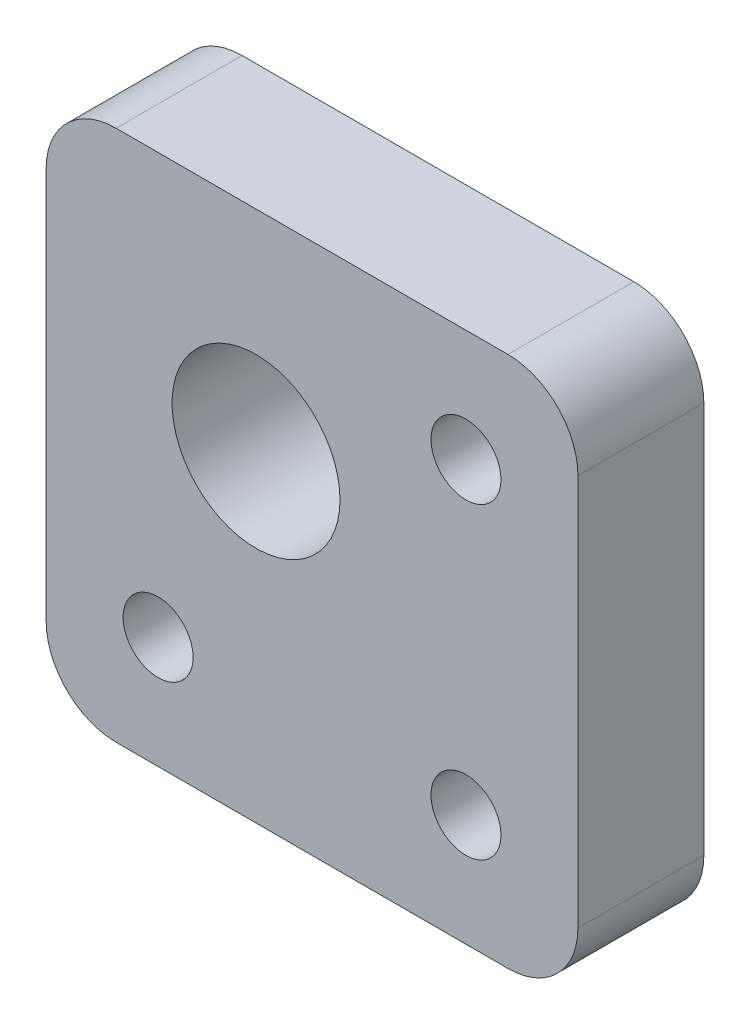
ISO-10303-21;
HEADER;
FILE_DESCRIPTION(('STEP AP214'),'2;1');
FILE_NAME('part.step','',(''),(''),'','','');
FILE_SCHEMA(('AUTOMOTIVE_DESIGN { 1 0 10303 214 1 1 1 1 }'));
ENDSEC;
DATA;
#1=APPLICATION_CONTEXT('core data for automotive mechanical design processes');
#2=APPLICATION_PROTOCOL_DEFINITION('international standard','automotive_design',2000,#1);
#3=PRODUCT_CONTEXT('',#1,'mechanical');
#4=PRODUCT('Part','Part','',(#3));
#5=PRODUCT_RELATED_PRODUCT_CATEGORY('part','',(#4));
#6=PRODUCT_DEFINITION_FORMATION('','',#4);
#7=PRODUCT_DEFINITION_CONTEXT('part definition',#1,'design');
#8=PRODUCT_DEFINITION('design','',#6,#7);
#9=PRODUCT_DEFINITION_SHAPE('','',#8);
#10=(LENGTH_UNIT() NAMED_UNIT(*) SI_UNIT(.MILLI.,.METRE.));
#11=(NAMED_UNIT(*) PLANE_ANGLE_UNIT() SI_UNIT($,.RADIAN.));
#12=(NAMED_UNIT(*) SI_UNIT($,.STERADIAN.) SOLID_ANGLE_UNIT());
#13=UNCERTAINTY_MEASURE_WITH_UNIT(LENGTH_MEASURE(1.E-05),#10,'distance_accuracy_value','');
#14=(GEOMETRIC_REPRESENTATION_CONTEXT(3) GLOBAL_UNCERTAINTY_ASSIGNED_CONTEXT((#13)) GLOBAL_UNIT_ASSIGNED_CONTEXT((#10,
#11,#12)) REPRESENTATION_CONTEXT('',''));
#15=CARTESIAN_POINT('',(0.,0.,0.));
#16=DIRECTION('',(0.,0.,1.));
#17=DIRECTION('',(1.,0.,0.));
#18=AXIS2_PLACEMENT_3D('',#15,#16,#17);
#19=CARTESIAN_POINT('',(0.,0.,9.));
#20=DIRECTION('',(0.,0.,1.));
#21=DIRECTION('',(1.,0.,0.));
#22=AXIS2_PLACEMENT_3D('',#19,#20,#21);
#23=PLANE('',#22);
#24=CARTESIAN_POINT('',(-13.1697995889595,-10.1602209944751,9.));
#25=DIRECTION('',(0.,0.,1.));
#26=DIRECTION('',(1.,0.,0.));
#27=AXIS2_PLACEMENT_3D('',#24,#25,#26);
#28=CIRCLE('',#27,2.5);
#29=CARTESIAN_POINT('',(-10.6697995889595,-10.1602209944751,9.));
#30=VERTEX_POINT('',#29);
#31=EDGE_CURVE('E187',#30,#30,#28,.T.);
#32=ORIENTED_EDGE('',*,*,#31,.F.);
#33=EDGE_LOOP('',(#32));
#34=FACE_BOUND('',#33,.T.);
#35=CARTESIAN_POINT('',(8.83020041104048,11.8397790055249,9.));
#36=DIRECTION('',(0.,0.,1.));
#37=DIRECTION('',(1.,0.,0.));
#38=AXIS2_PLACEMENT_3D('',#35,#36,#37);
#39=CIRCLE('',#38,2.5);
#40=CARTESIAN_POINT('',(11.3302004110405,11.8397790055249,9.));
#41=VERTEX_POINT('',#40);
#42=EDGE_CURVE('E128',#41,#41,#39,.T.);
#43=ORIENTED_EDGE('',*,*,#42,.F.);
#44=EDGE_LOOP('',(#43));
#45=FACE_BOUND('',#44,.T.);
#46=DIRECTION('',(-1.,0.,0.));
#47=VECTOR('',#46,1.);
#48=CARTESIAN_POINT('',(-21.1697995889595,19.8397790055249,9.));
#49=LINE('',#48,#47);
#50=CARTESIAN_POINT('',(11.8302004110405,19.8397790055249,9.));
#51=VERTEX_POINT('',#50);
#52=CARTESIAN_POINT('',(-16.1697995889595,19.8397790055249,9.));
#53=VERTEX_POINT('',#52);
#54=EDGE_CURVE('E137',#51,#53,#49,.T.);
#55=ORIENTED_EDGE('',*,*,#54,.T.);
#56=CARTESIAN_POINT('',(-16.1697995889595,14.8397790055249,9.));
#57=DIRECTION('',(0.,0.,1.));
#58=DIRECTION('',(1.,0.,0.));
#59=AXIS2_PLACEMENT_3D('',#56,#57,#58);
#60=CIRCLE('',#59,5.);
#61=CARTESIAN_POINT('',(-21.1697995889595,14.8397790055249,9.));
#62=VERTEX_POINT('',#61);
#63=EDGE_CURVE('E156',#53,#62,#60,.T.);
#64=ORIENTED_EDGE('',*,*,#63,.T.);
#65=DIRECTION('',(0.,-1.,0.));
#66=VECTOR('',#65,1.);
#67=CARTESIAN_POINT('',(-21.1697995889595,19.8397790055249,9.));
#68=LINE('',#67,#66);
#69=CARTESIAN_POINT('',(-21.1697995889595,-13.1602209944751,9.));
#70=VERTEX_POINT('',#69);
#71=EDGE_CURVE('E120',#62,#70,#68,.T.);
#72=ORIENTED_EDGE('',*,*,#71,.T.);
#73=CARTESIAN_POINT('',(-16.1697995889595,-13.1602209944751,9.));
#74=DIRECTION('',(0.,0.,1.));
#75=DIRECTION('',(1.,0.,0.));
#76=AXIS2_PLACEMENT_3D('',#73,#74,#75);
#77=CIRCLE('',#76,5.);
#78=CARTESIAN_POINT('',(-16.1697995889595,-18.1602209944751,9.));
#79=VERTEX_POINT('',#78);
#80=EDGE_CURVE('E154',#70,#79,#77,.T.);
#81=ORIENTED_EDGE('',*,*,#80,.T.);
#82=DIRECTION('',(1.,0.,0.));
#83=VECTOR('',#82,1.);
#84=CARTESIAN_POINT('',(-21.1697995889595,-18.1602209944751,9.));
#85=LINE('',#84,#83);
#86=CARTESIAN_POINT('',(11.8302004110405,-18.1602209944751,9.));
#87=VERTEX_POINT('',#86);
#88=EDGE_CURVE('E167',#79,#87,#85,.T.);
#89=ORIENTED_EDGE('',*,*,#88,.T.);
#90=CARTESIAN_POINT('',(11.8302004110405,-13.1602209944751,9.));
#91=DIRECTION('',(0.,0.,1.));
#92=DIRECTION('',(1.,0.,0.));
#93=AXIS2_PLACEMENT_3D('',#90,#91,#92);
#94=CIRCLE('',#93,5.);
#95=CARTESIAN_POINT('',(16.8302004110405,-13.1602209944751,9.));
#96=VERTEX_POINT('',#95);
#97=EDGE_CURVE('E55',#87,#96,#94,.T.);
#98=ORIENTED_EDGE('',*,*,#97,.T.);
#99=DIRECTION('',(0.,1.,0.));
#100=VECTOR('',#99,1.);
#101=CARTESIAN_POINT('',(16.8302004110405,19.8397790055249,9.));
#102=LINE('',#101,#100);
#103=CARTESIAN_POINT('',(16.8302004110405,14.8397790055249,9.));
#104=VERTEX_POINT('',#103);
#105=EDGE_CURVE('E175',#96,#104,#102,.T.);
#106=ORIENTED_EDGE('',*,*,#105,.T.);
#107=CARTESIAN_POINT('',(11.8302004110405,14.8397790055249,9.));
#108=DIRECTION('',(0.,0.,1.));
#109=DIRECTION('',(1.,0.,0.));
#110=AXIS2_PLACEMENT_3D('',#107,#108,#109);
#111=CIRCLE('',#110,5.);
#112=EDGE_CURVE('E151',#104,#51,#111,.T.);
#113=ORIENTED_EDGE('',*,*,#112,.T.);
#114=EDGE_LOOP('',(#55,#64,#72,#81,#89,#98,#106,#113));
#115=FACE_BOUND('',#114,.T.);
#116=CARTESIAN_POINT('',(8.83020041104049,-10.1602209944751,9.));
#117=DIRECTION('',(0.,0.,1.));
#118=DIRECTION('',(1.,0.,0.));
#119=AXIS2_PLACEMENT_3D('',#116,#117,#118);
#120=CIRCLE('',#119,2.5);
#121=CARTESIAN_POINT('',(11.3302004110405,-10.1602209944751,9.));
#122=VERTEX_POINT('',#121);
#123=EDGE_CURVE('E182',#122,#122,#120,.T.);
#124=ORIENTED_EDGE('',*,*,#123,.F.);
#125=EDGE_LOOP('',(#124));
#126=FACE_BOUND('',#125,.T.);
#127=CARTESIAN_POINT('',(-6.16979958895952,4.83977900552487,9.));
#128=DIRECTION('',(0.,0.,1.));
#129=DIRECTION('',(1.,0.,0.));
#130=AXIS2_PLACEMENT_3D('',#127,#128,#129);
#131=CIRCLE('',#130,6.);
#132=CARTESIAN_POINT('',(-0.169799588959522,4.83977900552487,9.));
#133=VERTEX_POINT('',#132);
#134=EDGE_CURVE('E193',#133,#133,#131,.T.);
#135=ORIENTED_EDGE('',*,*,#134,.F.);
#136=EDGE_LOOP('',(#135));
#137=FACE_BOUND('',#136,.T.);
#138=ADVANCED_FACE('F34',(#34,#45,#115,#126,#137),#23,.T.);
#139=CARTESIAN_POINT('',(0.,0.,0.));
#140=DIRECTION('',(0.,0.,1.));
#141=DIRECTION('',(1.,0.,0.));
#142=AXIS2_PLACEMENT_3D('',#139,#140,#141);
#143=PLANE('',#142);
#144=DIRECTION('',(0.,-1.,0.));
#145=VECTOR('',#144,1.);
#146=CARTESIAN_POINT('',(-21.1697995889595,19.8397790055249,0.));
#147=LINE('',#146,#145);
#148=CARTESIAN_POINT('',(-21.1697995889595,14.8397790055249,0.));
#149=VERTEX_POINT('',#148);
#150=CARTESIAN_POINT('',(-21.1697995889595,-13.1602209944751,0.));
#151=VERTEX_POINT('',#150);
#152=EDGE_CURVE('E117',#149,#151,#147,.T.);
#153=ORIENTED_EDGE('',*,*,#152,.F.);
#154=CARTESIAN_POINT('',(-16.1697995889595,14.8397790055249,0.));
#155=DIRECTION('',(0.,0.,1.));
#156=DIRECTION('',(1.,0.,0.));
#157=AXIS2_PLACEMENT_3D('',#154,#155,#156);
#158=CIRCLE('',#157,5.);
#159=CARTESIAN_POINT('',(-16.1697995889595,19.8397790055249,0.));
#160=VERTEX_POINT('',#159);
#161=EDGE_CURVE('E100',#149,#160,#158,.F.);
#162=ORIENTED_EDGE('',*,*,#161,.T.);
#163=DIRECTION('',(-1.,0.,0.));
#164=VECTOR('',#163,1.);
#165=CARTESIAN_POINT('',(-21.1697995889595,19.8397790055249,0.));
#166=LINE('',#165,#164);
#167=CARTESIAN_POINT('',(11.8302004110405,19.8397790055249,0.));
#168=VERTEX_POINT('',#167);
#169=EDGE_CURVE('E141',#168,#160,#166,.T.);
#170=ORIENTED_EDGE('',*,*,#169,.F.);
#171=CARTESIAN_POINT('',(11.8302004110405,14.8397790055249,0.));
#172=DIRECTION('',(0.,0.,1.));
#173=DIRECTION('',(1.,0.,0.));
#174=AXIS2_PLACEMENT_3D('',#171,#172,#173);
#175=CIRCLE('',#174,5.);
#176=CARTESIAN_POINT('',(16.8302004110405,14.8397790055249,0.));
#177=VERTEX_POINT('',#176);
#178=EDGE_CURVE('E121',#168,#177,#175,.F.);
#179=ORIENTED_EDGE('',*,*,#178,.T.);
#180=DIRECTION('',(0.,1.,0.));
#181=VECTOR('',#180,1.);
#182=CARTESIAN_POINT('',(16.8302004110405,19.8397790055249,0.));
#183=LINE('',#182,#181);
#184=CARTESIAN_POINT('',(16.8302004110405,-13.1602209944751,0.));
#185=VERTEX_POINT('',#184);
#186=EDGE_CURVE('E131',#185,#177,#183,.T.);
#187=ORIENTED_EDGE('',*,*,#186,.F.);
#188=CARTESIAN_POINT('',(11.8302004110405,-13.1602209944751,0.));
#189=DIRECTION('',(0.,0.,1.));
#190=DIRECTION('',(1.,0.,0.));
#191=AXIS2_PLACEMENT_3D('',#188,#189,#190);
#192=CIRCLE('',#191,5.);
#193=CARTESIAN_POINT('',(11.8302004110405,-18.1602209944751,0.));
#194=VERTEX_POINT('',#193);
#195=EDGE_CURVE('E145',#185,#194,#192,.F.);
#196=ORIENTED_EDGE('',*,*,#195,.T.);
#197=DIRECTION('',(1.,0.,0.));
#198=VECTOR('',#197,1.);
#199=CARTESIAN_POINT('',(-21.1697995889595,-18.1602209944751,0.));
#200=LINE('',#199,#198);
#201=CARTESIAN_POINT('',(-16.1697995889595,-18.1602209944751,0.));
#202=VERTEX_POINT('',#201);
#203=EDGE_CURVE('E127',#202,#194,#200,.T.);
#204=ORIENTED_EDGE('',*,*,#203,.F.);
#205=CARTESIAN_POINT('',(-16.1697995889595,-13.1602209944751,0.));
#206=DIRECTION('',(0.,0.,1.));
#207=DIRECTION('',(1.,0.,0.));
#208=AXIS2_PLACEMENT_3D('',#205,#206,#207);
#209=CIRCLE('',#208,5.);
#210=EDGE_CURVE('E111',#202,#151,#209,.F.);
#211=ORIENTED_EDGE('',*,*,#210,.T.);
#212=EDGE_LOOP('',(#153,#162,#170,#179,#187,#196,#204,#211));
#213=FACE_BOUND('',#212,.T.);
#214=CARTESIAN_POINT('',(8.83020041104048,11.8397790055249,0.));
#215=DIRECTION('',(0.,0.,1.));
#216=DIRECTION('',(1.,0.,0.));
#217=AXIS2_PLACEMENT_3D('',#214,#215,#216);
#218=CIRCLE('',#217,2.5);
#219=CARTESIAN_POINT('',(11.3302004110405,11.8397790055249,0.));
#220=VERTEX_POINT('',#219);
#221=EDGE_CURVE('E134',#220,#220,#218,.T.);
#222=ORIENTED_EDGE('',*,*,#221,.T.);
#223=EDGE_LOOP('',(#222));
#224=FACE_BOUND('',#223,.T.);
#225=CARTESIAN_POINT('',(8.83020041104049,-10.1602209944751,0.));
#226=DIRECTION('',(0.,0.,1.));
#227=DIRECTION('',(1.,0.,0.));
#228=AXIS2_PLACEMENT_3D('',#225,#226,#227);
#229=CIRCLE('',#228,2.5);
#230=CARTESIAN_POINT('',(11.3302004110405,-10.1602209944751,0.));
#231=VERTEX_POINT('',#230);
#232=EDGE_CURVE('E184',#231,#231,#229,.T.);
#233=ORIENTED_EDGE('',*,*,#232,.T.);
#234=EDGE_LOOP('',(#233));
#235=FACE_BOUND('',#234,.T.);
#236=CARTESIAN_POINT('',(-13.1697995889595,-10.1602209944751,0.));
#237=DIRECTION('',(0.,0.,1.));
#238=DIRECTION('',(1.,0.,0.));
#239=AXIS2_PLACEMENT_3D('',#236,#237,#238);
#240=CIRCLE('',#239,2.5);
#241=CARTESIAN_POINT('',(-10.6697995889595,-10.1602209944751,0.));
#242=VERTEX_POINT('',#241);
#243=EDGE_CURVE('E190',#242,#242,#240,.T.);
#244=ORIENTED_EDGE('',*,*,#243,.T.);
#245=EDGE_LOOP('',(#244));
#246=FACE_BOUND('',#245,.T.);
#247=CARTESIAN_POINT('',(-6.16979958895952,4.83977900552487,0.));
#248=DIRECTION('',(0.,0.,1.));
#249=DIRECTION('',(1.,0.,0.));
#250=AXIS2_PLACEMENT_3D('',#247,#248,#249);
#251=CIRCLE('',#250,6.);
#252=CARTESIAN_POINT('',(-0.169799588959522,4.83977900552487,0.));
#253=VERTEX_POINT('',#252);
#254=EDGE_CURVE('E196',#253,#253,#251,.T.);
#255=ORIENTED_EDGE('',*,*,#254,.T.);
#256=EDGE_LOOP('',(#255));
#257=FACE_BOUND('',#256,.T.);
#258=ADVANCED_FACE('F124',(#213,#224,#235,#246,#257),#143,.F.);
#259=CARTESIAN_POINT('',(-21.1697995889595,19.8397790055249,9.));
#260=DIRECTION('',(1.,0.,0.));
#261=DIRECTION('',(0.,1.,0.));
#262=AXIS2_PLACEMENT_3D('',#259,#260,#261);
#263=PLANE('',#262);
#264=ORIENTED_EDGE('',*,*,#71,.F.);
#265=DIRECTION('',(0.,0.,-1.));
#266=VECTOR('',#265,1.);
#267=CARTESIAN_POINT('',(-21.1697995889595,14.8397790055249,9.));
#268=LINE('',#267,#266);
#269=EDGE_CURVE('E104',#62,#149,#268,.T.);
#270=ORIENTED_EDGE('',*,*,#269,.T.);
#271=ORIENTED_EDGE('',*,*,#152,.T.);
#272=DIRECTION('',(0.,0.,-1.));
#273=VECTOR('',#272,1.);
#274=CARTESIAN_POINT('',(-21.1697995889595,-13.1602209944751,9.));
#275=LINE('',#274,#273);
#276=EDGE_CURVE('E122',#151,#70,#275,.F.);
#277=ORIENTED_EDGE('',*,*,#276,.T.);
#278=EDGE_LOOP('',(#264,#270,#271,#277));
#279=FACE_BOUND('',#278,.T.);
#280=ADVANCED_FACE('F116',(#279),#263,.F.);
#281=CARTESIAN_POINT('',(-21.1697995889595,-18.1602209944751,9.));
#282=DIRECTION('',(0.,1.,0.));
#283=DIRECTION('',(0.,0.,1.));
#284=AXIS2_PLACEMENT_3D('',#281,#282,#283);
#285=PLANE('',#284);
#286=ORIENTED_EDGE('',*,*,#88,.F.);
#287=DIRECTION('',(0.,0.,-1.));
#288=VECTOR('',#287,1.);
#289=CARTESIAN_POINT('',(-16.1697995889595,-18.1602209944751,9.));
#290=LINE('',#289,#288);
#291=EDGE_CURVE('E160',#79,#202,#290,.T.);
#292=ORIENTED_EDGE('',*,*,#291,.T.);
#293=ORIENTED_EDGE('',*,*,#203,.T.);
#294=DIRECTION('',(0.,0.,-1.));
#295=VECTOR('',#294,1.);
#296=CARTESIAN_POINT('',(11.8302004110405,-18.1602209944751,9.));
#297=LINE('',#296,#295);
#298=EDGE_CURVE('E158',#194,#87,#297,.F.);
#299=ORIENTED_EDGE('',*,*,#298,.T.);
#300=EDGE_LOOP('',(#286,#292,#293,#299));
#301=FACE_BOUND('',#300,.T.);
#302=ADVANCED_FACE('F165',(#301),#285,.F.);
#303=CARTESIAN_POINT('',(16.8302004110405,19.8397790055249,9.));
#304=DIRECTION('',(-1.,0.,0.));
#305=DIRECTION('',(0.,-1.,0.));
#306=AXIS2_PLACEMENT_3D('',#303,#304,#305);
#307=PLANE('',#306);
#308=ORIENTED_EDGE('',*,*,#105,.F.);
#309=DIRECTION('',(0.,0.,-1.));
#310=VECTOR('',#309,1.);
#311=CARTESIAN_POINT('',(16.8302004110405,-13.1602209944751,9.));
#312=LINE('',#311,#310);
#313=EDGE_CURVE('E11',#96,#185,#312,.T.);
#314=ORIENTED_EDGE('',*,*,#313,.T.);
#315=ORIENTED_EDGE('',*,*,#186,.T.);
#316=DIRECTION('',(0.,0.,-1.));
#317=VECTOR('',#316,1.);
#318=CARTESIAN_POINT('',(16.8302004110405,14.8397790055249,9.));
#319=LINE('',#318,#317);
#320=EDGE_CURVE('E42',#177,#104,#319,.F.);
#321=ORIENTED_EDGE('',*,*,#320,.T.);
#322=EDGE_LOOP('',(#308,#314,#315,#321));
#323=FACE_BOUND('',#322,.T.);
#324=ADVANCED_FACE('F174',(#323),#307,.F.);
#325=CARTESIAN_POINT('',(-21.1697995889595,19.8397790055249,9.));
#326=DIRECTION('',(0.,-1.,0.));
#327=DIRECTION('',(1.,0.,0.));
#328=AXIS2_PLACEMENT_3D('',#325,#326,#327);
#329=PLANE('',#328);
#330=ORIENTED_EDGE('',*,*,#169,.T.);
#331=DIRECTION('',(0.,0.,-1.));
#332=VECTOR('',#331,1.);
#333=CARTESIAN_POINT('',(-16.1697995889595,19.8397790055249,9.));
#334=LINE('',#333,#332);
#335=EDGE_CURVE('E105',#160,#53,#334,.F.);
#336=ORIENTED_EDGE('',*,*,#335,.T.);
#337=ORIENTED_EDGE('',*,*,#54,.F.);
#338=DIRECTION('',(0.,0.,-1.));
#339=VECTOR('',#338,1.);
#340=CARTESIAN_POINT('',(11.8302004110405,19.8397790055249,9.));
#341=LINE('',#340,#339);
#342=EDGE_CURVE('E110',#51,#168,#341,.T.);
#343=ORIENTED_EDGE('',*,*,#342,.T.);
#344=EDGE_LOOP('',(#330,#336,#337,#343));
#345=FACE_BOUND('',#344,.T.);
#346=ADVANCED_FACE('F218',(#345),#329,.F.);
#347=CARTESIAN_POINT('',(8.83020041104048,11.8397790055249,9.));
#348=DIRECTION('',(0.,0.,-1.));
#349=DIRECTION('',(-1.,0.,0.));
#350=AXIS2_PLACEMENT_3D('',#347,#348,#349);
#351=CYLINDRICAL_SURFACE('',#350,2.5);
#352=ORIENTED_EDGE('',*,*,#42,.T.);
#353=EDGE_LOOP('',(#352));
#354=FACE_BOUND('',#353,.T.);
#355=ORIENTED_EDGE('',*,*,#221,.F.);
#356=EDGE_LOOP('',(#355));
#357=FACE_BOUND('',#356,.T.);
#358=ADVANCED_FACE('F215',(#354,#357),#351,.F.);
#359=CARTESIAN_POINT('',(8.83020041104049,-10.1602209944751,9.));
#360=DIRECTION('',(0.,0.,-1.));
#361=DIRECTION('',(-1.,0.,0.));
#362=AXIS2_PLACEMENT_3D('',#359,#360,#361);
#363=CYLINDRICAL_SURFACE('',#362,2.5);
#364=ORIENTED_EDGE('',*,*,#123,.T.);
#365=EDGE_LOOP('',(#364));
#366=FACE_BOUND('',#365,.T.);
#367=ORIENTED_EDGE('',*,*,#232,.F.);
#368=EDGE_LOOP('',(#367));
#369=FACE_BOUND('',#368,.T.);
#370=ADVANCED_FACE('F244',(#366,#369),#363,.F.);
#371=CARTESIAN_POINT('',(-13.1697995889595,-10.1602209944751,9.));
#372=DIRECTION('',(0.,0.,-1.));
#373=DIRECTION('',(-1.,0.,0.));
#374=AXIS2_PLACEMENT_3D('',#371,#372,#373);
#375=CYLINDRICAL_SURFACE('',#374,2.5);
#376=ORIENTED_EDGE('',*,*,#31,.T.);
#377=EDGE_LOOP('',(#376));
#378=FACE_BOUND('',#377,.T.);
#379=ORIENTED_EDGE('',*,*,#243,.F.);
#380=EDGE_LOOP('',(#379));
#381=FACE_BOUND('',#380,.T.);
#382=ADVANCED_FACE('F247',(#378,#381),#375,.F.);
#383=CARTESIAN_POINT('',(-6.16979958895952,4.83977900552487,9.));
#384=DIRECTION('',(0.,0.,-1.));
#385=DIRECTION('',(-1.,0.,0.));
#386=AXIS2_PLACEMENT_3D('',#383,#384,#385);
#387=CYLINDRICAL_SURFACE('',#386,6.);
#388=ORIENTED_EDGE('',*,*,#134,.T.);
#389=EDGE_LOOP('',(#388));
#390=FACE_BOUND('',#389,.T.);
#391=ORIENTED_EDGE('',*,*,#254,.F.);
#392=EDGE_LOOP('',(#391));
#393=FACE_BOUND('',#392,.T.);
#394=ADVANCED_FACE('F202',(#390,#393),#387,.F.);
#395=CARTESIAN_POINT('',(-16.1697995889595,14.8397790055249,9.));
#396=DIRECTION('',(0.,0.,-1.));
#397=DIRECTION('',(-1.,0.,0.));
#398=AXIS2_PLACEMENT_3D('',#395,#396,#397);
#399=CYLINDRICAL_SURFACE('',#398,5.);
#400=ORIENTED_EDGE('',*,*,#63,.F.);
#401=ORIENTED_EDGE('',*,*,#335,.F.);
#402=ORIENTED_EDGE('',*,*,#161,.F.);
#403=ORIENTED_EDGE('',*,*,#269,.F.);
#404=EDGE_LOOP('',(#400,#401,#402,#403));
#405=FACE_BOUND('',#404,.T.);
#406=ADVANCED_FACE('F103',(#405),#399,.T.);
#407=CARTESIAN_POINT('',(-16.1697995889595,-13.1602209944751,9.));
#408=DIRECTION('',(0.,0.,-1.));
#409=DIRECTION('',(-1.,0.,0.));
#410=AXIS2_PLACEMENT_3D('',#407,#408,#409);
#411=CYLINDRICAL_SURFACE('',#410,5.);
#412=ORIENTED_EDGE('',*,*,#80,.F.);
#413=ORIENTED_EDGE('',*,*,#276,.F.);
#414=ORIENTED_EDGE('',*,*,#210,.F.);
#415=ORIENTED_EDGE('',*,*,#291,.F.);
#416=EDGE_LOOP('',(#412,#413,#414,#415));
#417=FACE_BOUND('',#416,.T.);
#418=ADVANCED_FACE('F230',(#417),#411,.T.);
#419=CARTESIAN_POINT('',(11.8302004110405,-13.1602209944751,9.));
#420=DIRECTION('',(0.,0.,-1.));
#421=DIRECTION('',(-1.,0.,0.));
#422=AXIS2_PLACEMENT_3D('',#419,#420,#421);
#423=CYLINDRICAL_SURFACE('',#422,5.);
#424=ORIENTED_EDGE('',*,*,#97,.F.);
#425=ORIENTED_EDGE('',*,*,#298,.F.);
#426=ORIENTED_EDGE('',*,*,#195,.F.);
#427=ORIENTED_EDGE('',*,*,#313,.F.);
#428=EDGE_LOOP('',(#424,#425,#426,#427));
#429=FACE_BOUND('',#428,.T.);
#430=ADVANCED_FACE('F173',(#429),#423,.T.);
#431=CARTESIAN_POINT('',(11.8302004110405,14.8397790055249,9.));
#432=DIRECTION('',(0.,0.,-1.));
#433=DIRECTION('',(-1.,0.,0.));
#434=AXIS2_PLACEMENT_3D('',#431,#432,#433);
#435=CYLINDRICAL_SURFACE('',#434,5.);
#436=ORIENTED_EDGE('',*,*,#112,.F.);
#437=ORIENTED_EDGE('',*,*,#320,.F.);
#438=ORIENTED_EDGE('',*,*,#178,.F.);
#439=ORIENTED_EDGE('',*,*,#342,.F.);
#440=EDGE_LOOP('',(#436,#437,#438,#439));
#441=FACE_BOUND('',#440,.T.);
#442=ADVANCED_FACE('F36',(#441),#435,.T.);
#443=CLOSED_SHELL('',(#138,#258,#280,#302,#324,#346,#358,#370,#382,#394,#406,#418,#430,#442));
#444=MANIFOLD_SOLID_BREP('B2',#443);
#445=ADVANCED_BREP_SHAPE_REPRESENTATION('',(#18,#444),#14);
#446=SHAPE_DEFINITION_REPRESENTATION(#9,#445);
ENDSEC;
END-ISO-10303-21;
